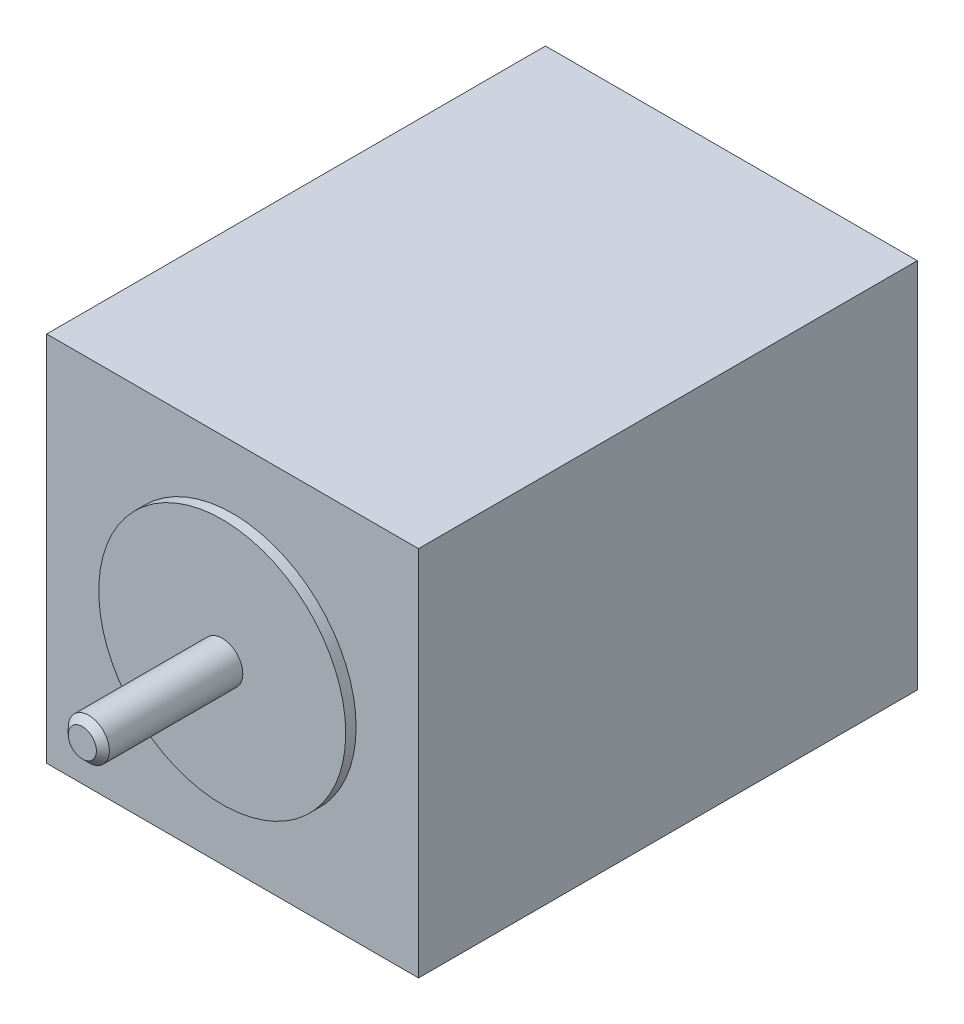
ISO-10303-21;
HEADER;
FILE_DESCRIPTION(('STEP AP214'),'2;1');
FILE_NAME('part.step','',(''),(''),'','','');
FILE_SCHEMA(('AUTOMOTIVE_DESIGN { 1 0 10303 214 1 1 1 1 }'));
ENDSEC;
DATA;
#1=APPLICATION_CONTEXT('core data for automotive mechanical design processes');
#2=APPLICATION_PROTOCOL_DEFINITION('international standard','automotive_design',2000,#1);
#3=PRODUCT_CONTEXT('',#1,'mechanical');
#4=PRODUCT('Part','Part','',(#3));
#5=PRODUCT_RELATED_PRODUCT_CATEGORY('part','',(#4));
#6=PRODUCT_DEFINITION_FORMATION('','',#4);
#7=PRODUCT_DEFINITION_CONTEXT('part definition',#1,'design');
#8=PRODUCT_DEFINITION('design','',#6,#7);
#9=PRODUCT_DEFINITION_SHAPE('','',#8);
#10=(LENGTH_UNIT() NAMED_UNIT(*) SI_UNIT(.MILLI.,.METRE.));
#11=(NAMED_UNIT(*) PLANE_ANGLE_UNIT() SI_UNIT($,.RADIAN.));
#12=(NAMED_UNIT(*) SI_UNIT($,.STERADIAN.) SOLID_ANGLE_UNIT());
#13=UNCERTAINTY_MEASURE_WITH_UNIT(LENGTH_MEASURE(1.E-05),#10,'distance_accuracy_value','');
#14=(GEOMETRIC_REPRESENTATION_CONTEXT(3) GLOBAL_UNCERTAINTY_ASSIGNED_CONTEXT((#13)) GLOBAL_UNIT_ASSIGNED_CONTEXT((#10,
#11,#12)) REPRESENTATION_CONTEXT('',''));
#15=CARTESIAN_POINT('',(0.,0.,0.));
#16=DIRECTION('',(0.,0.,1.));
#17=DIRECTION('',(1.,0.,0.));
#18=AXIS2_PLACEMENT_3D('',#15,#16,#17);
#19=CARTESIAN_POINT('',(28.7,28.7,1.6));
#20=DIRECTION('',(0.,0.,1.));
#21=DIRECTION('',(1.,0.,0.));
#22=AXIS2_PLACEMENT_3D('',#19,#20,#21);
#23=PLANE('',#22);
#24=CARTESIAN_POINT('',(28.7,28.7,1.6));
#25=DIRECTION('',(0.,0.,1.));
#26=DIRECTION('',(1.,0.,0.));
#27=AXIS2_PLACEMENT_3D('',#24,#25,#26);
#28=CIRCLE('',#27,19.065);
#29=CARTESIAN_POINT('',(47.765,28.7,1.6));
#30=VERTEX_POINT('',#29);
#31=EDGE_CURVE('E108',#30,#30,#28,.T.);
#32=ORIENTED_EDGE('',*,*,#31,.T.);
#33=EDGE_LOOP('',(#32));
#34=FACE_BOUND('',#33,.T.);
#35=CARTESIAN_POINT('',(28.7,28.7,1.6));
#36=DIRECTION('',(0.,0.,1.));
#37=DIRECTION('',(1.,0.,0.));
#38=AXIS2_PLACEMENT_3D('',#35,#36,#37);
#39=CIRCLE('',#38,3.175);
#40=CARTESIAN_POINT('',(31.875,28.7,1.6));
#41=VERTEX_POINT('',#40);
#42=EDGE_CURVE('E162',#41,#41,#39,.T.);
#43=ORIENTED_EDGE('',*,*,#42,.F.);
#44=EDGE_LOOP('',(#43));
#45=FACE_BOUND('',#44,.T.);
#46=ADVANCED_FACE('F35',(#34,#45),#23,.T.);
#47=CARTESIAN_POINT('',(0.,0.,0.));
#48=DIRECTION('',(0.,0.,1.));
#49=DIRECTION('',(1.,0.,0.));
#50=AXIS2_PLACEMENT_3D('',#47,#48,#49);
#51=PLANE('',#50);
#52=DIRECTION('',(0.,-1.,0.));
#53=VECTOR('',#52,1.);
#54=CARTESIAN_POINT('',(0.,57.4,0.));
#55=LINE('',#54,#53);
#56=CARTESIAN_POINT('',(0.,57.4,0.));
#57=VERTEX_POINT('',#56);
#58=CARTESIAN_POINT('',(0.,0.,0.));
#59=VERTEX_POINT('',#58);
#60=EDGE_CURVE('E104',#57,#59,#55,.T.);
#61=ORIENTED_EDGE('',*,*,#60,.T.);
#62=DIRECTION('',(1.,0.,0.));
#63=VECTOR('',#62,1.);
#64=CARTESIAN_POINT('',(0.,0.,0.));
#65=LINE('',#64,#63);
#66=CARTESIAN_POINT('',(57.4,0.,0.));
#67=VERTEX_POINT('',#66);
#68=EDGE_CURVE('E107',#59,#67,#65,.T.);
#69=ORIENTED_EDGE('',*,*,#68,.T.);
#70=DIRECTION('',(0.,1.,0.));
#71=VECTOR('',#70,1.);
#72=CARTESIAN_POINT('',(57.4,0.,0.));
#73=LINE('',#72,#71);
#74=CARTESIAN_POINT('',(57.4,57.4,0.));
#75=VERTEX_POINT('',#74);
#76=EDGE_CURVE('E88',#67,#75,#73,.T.);
#77=ORIENTED_EDGE('',*,*,#76,.T.);
#78=DIRECTION('',(-1.,0.,0.));
#79=VECTOR('',#78,1.);
#80=CARTESIAN_POINT('',(57.4,57.4,0.));
#81=LINE('',#80,#79);
#82=EDGE_CURVE('E99',#75,#57,#81,.T.);
#83=ORIENTED_EDGE('',*,*,#82,.T.);
#84=EDGE_LOOP('',(#61,#69,#77,#83));
#85=FACE_BOUND('',#84,.T.);
#86=CARTESIAN_POINT('',(28.7,28.7,0.));
#87=DIRECTION('',(0.,0.,1.));
#88=DIRECTION('',(1.,0.,0.));
#89=AXIS2_PLACEMENT_3D('',#86,#87,#88);
#90=CIRCLE('',#89,19.065);
#91=CARTESIAN_POINT('',(47.765,28.7,0.));
#92=VERTEX_POINT('',#91);
#93=EDGE_CURVE('E160',#92,#92,#90,.T.);
#94=ORIENTED_EDGE('',*,*,#93,.F.);
#95=EDGE_LOOP('',(#94));
#96=FACE_BOUND('',#95,.T.);
#97=ADVANCED_FACE('F129',(#85,#96),#51,.T.);
#98=CARTESIAN_POINT('',(0.,57.4,-77.));
#99=DIRECTION('',(-1.,0.,0.));
#100=DIRECTION('',(0.,-1.,0.));
#101=AXIS2_PLACEMENT_3D('',#98,#99,#100);
#102=PLANE('',#101);
#103=ORIENTED_EDGE('',*,*,#60,.F.);
#104=DIRECTION('',(0.,0.,1.));
#105=VECTOR('',#104,1.);
#106=CARTESIAN_POINT('',(0.,57.4,-77.));
#107=LINE('',#106,#105);
#108=CARTESIAN_POINT('',(0.,57.4,-77.));
#109=VERTEX_POINT('',#108);
#110=EDGE_CURVE('E52',#109,#57,#107,.T.);
#111=ORIENTED_EDGE('',*,*,#110,.F.);
#112=DIRECTION('',(0.,-1.,0.));
#113=VECTOR('',#112,1.);
#114=CARTESIAN_POINT('',(0.,57.4,-77.));
#115=LINE('',#114,#113);
#116=CARTESIAN_POINT('',(0.,0.,-77.));
#117=VERTEX_POINT('',#116);
#118=EDGE_CURVE('E97',#109,#117,#115,.T.);
#119=ORIENTED_EDGE('',*,*,#118,.T.);
#120=DIRECTION('',(0.,0.,1.));
#121=VECTOR('',#120,1.);
#122=CARTESIAN_POINT('',(0.,0.,-77.));
#123=LINE('',#122,#121);
#124=EDGE_CURVE('E80',#117,#59,#123,.T.);
#125=ORIENTED_EDGE('',*,*,#124,.T.);
#126=EDGE_LOOP('',(#103,#111,#119,#125));
#127=FACE_BOUND('',#126,.T.);
#128=ADVANCED_FACE('F135',(#127),#102,.T.);
#129=CARTESIAN_POINT('',(57.4,57.4,-77.));
#130=DIRECTION('',(0.,1.,0.));
#131=DIRECTION('',(0.,0.,1.));
#132=AXIS2_PLACEMENT_3D('',#129,#130,#131);
#133=PLANE('',#132);
#134=ORIENTED_EDGE('',*,*,#82,.F.);
#135=DIRECTION('',(0.,0.,1.));
#136=VECTOR('',#135,1.);
#137=CARTESIAN_POINT('',(57.4,57.4,-77.));
#138=LINE('',#137,#136);
#139=CARTESIAN_POINT('',(57.4,57.4,-77.));
#140=VERTEX_POINT('',#139);
#141=EDGE_CURVE('E69',#140,#75,#138,.T.);
#142=ORIENTED_EDGE('',*,*,#141,.F.);
#143=DIRECTION('',(-1.,0.,0.));
#144=VECTOR('',#143,1.);
#145=CARTESIAN_POINT('',(57.4,57.4,-77.));
#146=LINE('',#145,#144);
#147=EDGE_CURVE('E94',#140,#109,#146,.T.);
#148=ORIENTED_EDGE('',*,*,#147,.T.);
#149=ORIENTED_EDGE('',*,*,#110,.T.);
#150=EDGE_LOOP('',(#134,#142,#148,#149));
#151=FACE_BOUND('',#150,.T.);
#152=ADVANCED_FACE('F148',(#151),#133,.T.);
#153=CARTESIAN_POINT('',(57.4,0.,-77.));
#154=DIRECTION('',(1.,0.,0.));
#155=DIRECTION('',(0.,1.,0.));
#156=AXIS2_PLACEMENT_3D('',#153,#154,#155);
#157=PLANE('',#156);
#158=ORIENTED_EDGE('',*,*,#76,.F.);
#159=DIRECTION('',(0.,0.,1.));
#160=VECTOR('',#159,1.);
#161=CARTESIAN_POINT('',(57.4,0.,-77.));
#162=LINE('',#161,#160);
#163=CARTESIAN_POINT('',(57.4,0.,-77.));
#164=VERTEX_POINT('',#163);
#165=EDGE_CURVE('E83',#164,#67,#162,.T.);
#166=ORIENTED_EDGE('',*,*,#165,.F.);
#167=DIRECTION('',(0.,1.,0.));
#168=VECTOR('',#167,1.);
#169=CARTESIAN_POINT('',(57.4,0.,-77.));
#170=LINE('',#169,#168);
#171=EDGE_CURVE('E86',#164,#140,#170,.T.);
#172=ORIENTED_EDGE('',*,*,#171,.T.);
#173=ORIENTED_EDGE('',*,*,#141,.T.);
#174=EDGE_LOOP('',(#158,#166,#172,#173));
#175=FACE_BOUND('',#174,.T.);
#176=ADVANCED_FACE('F85',(#175),#157,.T.);
#177=CARTESIAN_POINT('',(0.,0.,-77.));
#178=DIRECTION('',(0.,-1.,0.));
#179=DIRECTION('',(0.,0.,-1.));
#180=AXIS2_PLACEMENT_3D('',#177,#178,#179);
#181=PLANE('',#180);
#182=ORIENTED_EDGE('',*,*,#68,.F.);
#183=ORIENTED_EDGE('',*,*,#124,.F.);
#184=DIRECTION('',(1.,0.,0.));
#185=VECTOR('',#184,1.);
#186=CARTESIAN_POINT('',(0.,0.,-77.));
#187=LINE('',#186,#185);
#188=EDGE_CURVE('E93',#117,#164,#187,.T.);
#189=ORIENTED_EDGE('',*,*,#188,.T.);
#190=ORIENTED_EDGE('',*,*,#165,.T.);
#191=EDGE_LOOP('',(#182,#183,#189,#190));
#192=FACE_BOUND('',#191,.T.);
#193=ADVANCED_FACE('F96',(#192),#181,.T.);
#194=CARTESIAN_POINT('',(0.,0.,-77.));
#195=DIRECTION('',(0.,0.,1.));
#196=DIRECTION('',(1.,0.,0.));
#197=AXIS2_PLACEMENT_3D('',#194,#195,#196);
#198=PLANE('',#197);
#199=ORIENTED_EDGE('',*,*,#118,.F.);
#200=ORIENTED_EDGE('',*,*,#147,.F.);
#201=ORIENTED_EDGE('',*,*,#171,.F.);
#202=ORIENTED_EDGE('',*,*,#188,.F.);
#203=EDGE_LOOP('',(#199,#200,#201,#202));
#204=FACE_BOUND('',#203,.T.);
#205=ADVANCED_FACE('F92',(#204),#198,.F.);
#206=CARTESIAN_POINT('',(28.7,28.7,1.6));
#207=DIRECTION('',(0.,0.,-1.));
#208=DIRECTION('',(-1.,0.,0.));
#209=AXIS2_PLACEMENT_3D('',#206,#207,#208);
#210=CYLINDRICAL_SURFACE('',#209,19.065);
#211=ORIENTED_EDGE('',*,*,#31,.F.);
#212=EDGE_LOOP('',(#211));
#213=FACE_BOUND('',#212,.T.);
#214=ORIENTED_EDGE('',*,*,#93,.T.);
#215=EDGE_LOOP('',(#214));
#216=FACE_BOUND('',#215,.T.);
#217=ADVANCED_FACE('F142',(#213,#216),#210,.T.);
#218=CARTESIAN_POINT('',(28.7,28.7,23.2));
#219=DIRECTION('',(0.,0.,-1.));
#220=DIRECTION('',(-1.,0.,0.));
#221=AXIS2_PLACEMENT_3D('',#218,#219,#220);
#222=CYLINDRICAL_SURFACE('',#221,3.175);
#223=CARTESIAN_POINT('',(28.7,28.7,22.2000000000001));
#224=DIRECTION('',(0.,0.,1.));
#225=DIRECTION('',(1.,0.,0.));
#226=AXIS2_PLACEMENT_3D('',#223,#224,#225);
#227=CIRCLE('',#226,3.175);
#228=CARTESIAN_POINT('',(31.875,28.7,22.2000000000001));
#229=VERTEX_POINT('',#228);
#230=EDGE_CURVE('E11',#229,#229,#227,.F.);
#231=ORIENTED_EDGE('',*,*,#230,.T.);
#232=EDGE_LOOP('',(#231));
#233=FACE_BOUND('',#232,.T.);
#234=ORIENTED_EDGE('',*,*,#42,.T.);
#235=EDGE_LOOP('',(#234));
#236=FACE_BOUND('',#235,.T.);
#237=ADVANCED_FACE('F125',(#233,#236),#222,.T.);
#238=CARTESIAN_POINT('',(28.7,28.7,23.2));
#239=DIRECTION('',(0.,0.,1.));
#240=DIRECTION('',(1.,0.,0.));
#241=AXIS2_PLACEMENT_3D('',#238,#239,#240);
#242=PLANE('',#241);
#243=CARTESIAN_POINT('',(28.7,28.7,23.2));
#244=DIRECTION('',(0.,0.,1.));
#245=DIRECTION('',(1.,0.,0.));
#246=AXIS2_PLACEMENT_3D('',#243,#244,#245);
#247=CIRCLE('',#246,2.17500000000008);
#248=CARTESIAN_POINT('',(30.8750000000001,28.7,23.2));
#249=VERTEX_POINT('',#248);
#250=EDGE_CURVE('E44',#249,#249,#247,.T.);
#251=ORIENTED_EDGE('',*,*,#250,.T.);
#252=EDGE_LOOP('',(#251));
#253=FACE_BOUND('',#252,.T.);
#254=ADVANCED_FACE('F118',(#253),#242,.T.);
#255=CARTESIAN_POINT('',(28.7,28.7,23.2));
#256=DIRECTION('',(0.,0.,-1.));
#257=DIRECTION('',(-1.,0.,0.));
#258=AXIS2_PLACEMENT_3D('',#255,#256,#257);
#259=CONICAL_SURFACE('',#258,2.17500000000008,0.78539816339745);
#260=ORIENTED_EDGE('',*,*,#230,.F.);
#261=EDGE_LOOP('',(#260));
#262=FACE_BOUND('',#261,.T.);
#263=ORIENTED_EDGE('',*,*,#250,.F.);
#264=EDGE_LOOP('',(#263));
#265=FACE_BOUND('',#264,.T.);
#266=ADVANCED_FACE('F37',(#262,#265),#259,.T.);
#267=CLOSED_SHELL('',(#46,#97,#128,#152,#176,#193,#205,#217,#237,#254,#266));
#268=MANIFOLD_SOLID_BREP('B2',#267);
#269=ADVANCED_BREP_SHAPE_REPRESENTATION('',(#18,#268),#14);
#270=SHAPE_DEFINITION_REPRESENTATION(#9,#269);
ENDSEC;
END-ISO-10303-21;
